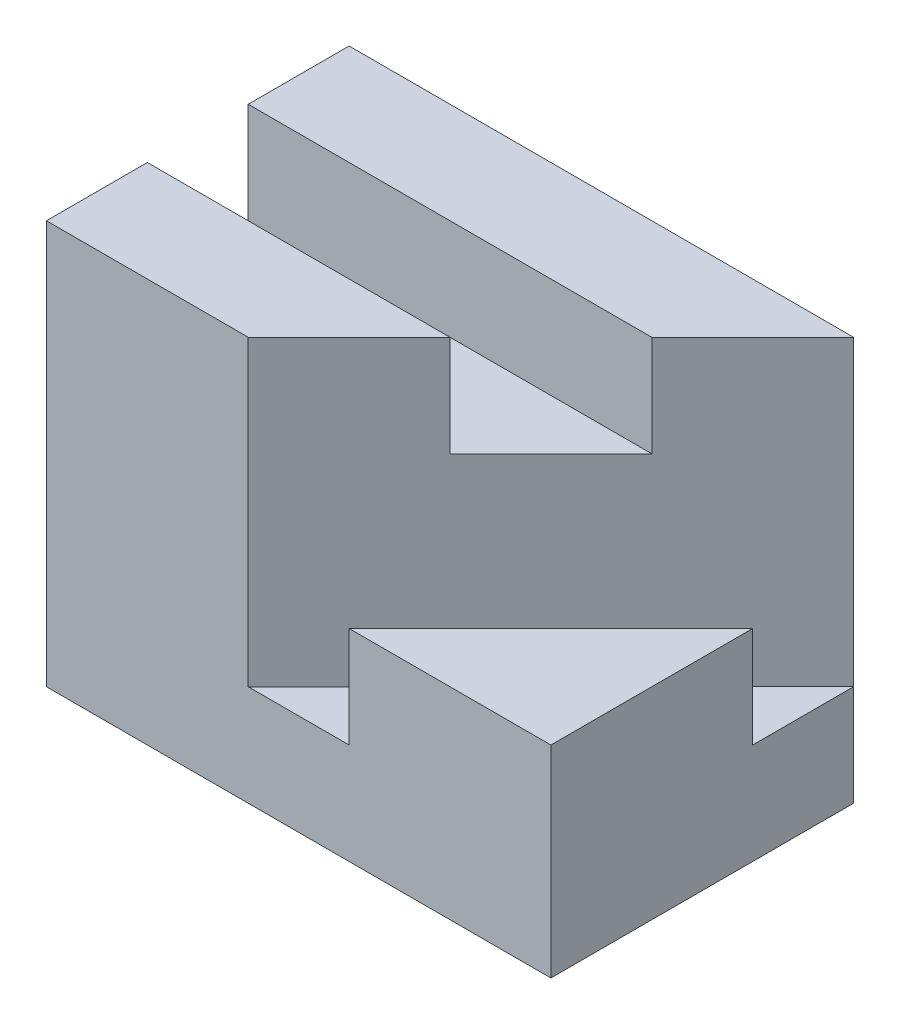
ISO-10303-21;
HEADER;
FILE_DESCRIPTION(('STEP AP214'),'2;1');
FILE_NAME('part.step','',(''),(''),'','','');
FILE_SCHEMA(('AUTOMOTIVE_DESIGN { 1 0 10303 214 1 1 1 1 }'));
ENDSEC;
DATA;
#1=APPLICATION_CONTEXT('core data for automotive mechanical design processes');
#2=APPLICATION_PROTOCOL_DEFINITION('international standard','automotive_design',2000,#1);
#3=PRODUCT_CONTEXT('',#1,'mechanical');
#4=PRODUCT('Part','Part','',(#3));
#5=PRODUCT_RELATED_PRODUCT_CATEGORY('part','',(#4));
#6=PRODUCT_DEFINITION_FORMATION('','',#4);
#7=PRODUCT_DEFINITION_CONTEXT('part definition',#1,'design');
#8=PRODUCT_DEFINITION('design','',#6,#7);
#9=PRODUCT_DEFINITION_SHAPE('','',#8);
#10=(LENGTH_UNIT() NAMED_UNIT(*) SI_UNIT(.MILLI.,.METRE.));
#11=(NAMED_UNIT(*) PLANE_ANGLE_UNIT() SI_UNIT($,.RADIAN.));
#12=(NAMED_UNIT(*) SI_UNIT($,.STERADIAN.) SOLID_ANGLE_UNIT());
#13=UNCERTAINTY_MEASURE_WITH_UNIT(LENGTH_MEASURE(1.E-05),#10,'distance_accuracy_value','');
#14=(GEOMETRIC_REPRESENTATION_CONTEXT(3) GLOBAL_UNCERTAINTY_ASSIGNED_CONTEXT((#13)) GLOBAL_UNIT_ASSIGNED_CONTEXT((#10,
#11,#12)) REPRESENTATION_CONTEXT('',''));
#15=CARTESIAN_POINT('',(0.,0.,0.));
#16=DIRECTION('',(0.,0.,1.));
#17=DIRECTION('',(1.,0.,0.));
#18=AXIS2_PLACEMENT_3D('',#15,#16,#17);
#19=CARTESIAN_POINT('',(2.5,4.,-1.5));
#20=DIRECTION('',(-1.,0.,0.));
#21=DIRECTION('',(0.,0.,1.));
#22=AXIS2_PLACEMENT_3D('',#19,#20,#21);
#23=PLANE('',#22);
#24=DIRECTION('',(0.,0.,-1.));
#25=VECTOR('',#24,1.);
#26=CARTESIAN_POINT('',(2.5,2.,0.));
#27=LINE('',#26,#25);
#28=CARTESIAN_POINT('',(2.5,2.,1.5));
#29=VERTEX_POINT('',#28);
#30=CARTESIAN_POINT('',(2.5,2.,-0.499999999999995));
#31=VERTEX_POINT('',#30);
#32=EDGE_CURVE('E48',#29,#31,#27,.T.);
#33=ORIENTED_EDGE('',*,*,#32,.F.);
#34=DIRECTION('',(0.,-1.,0.));
#35=VECTOR('',#34,1.);
#36=CARTESIAN_POINT('',(2.5,4.,1.5));
#37=LINE('',#36,#35);
#38=CARTESIAN_POINT('',(2.5,0.,1.5));
#39=VERTEX_POINT('',#38);
#40=EDGE_CURVE('E131',#29,#39,#37,.T.);
#41=ORIENTED_EDGE('',*,*,#40,.T.);
#42=DIRECTION('',(0.,0.,-1.));
#43=VECTOR('',#42,1.);
#44=CARTESIAN_POINT('',(2.5,0.,-1.5));
#45=LINE('',#44,#43);
#46=CARTESIAN_POINT('',(2.5,0.,-1.5));
#47=VERTEX_POINT('',#46);
#48=EDGE_CURVE('E187',#39,#47,#45,.T.);
#49=ORIENTED_EDGE('',*,*,#48,.T.);
#50=DIRECTION('',(0.,-1.,0.));
#51=VECTOR('',#50,1.);
#52=CARTESIAN_POINT('',(2.5,4.,-1.5));
#53=LINE('',#52,#51);
#54=CARTESIAN_POINT('',(2.5,1.,-1.5));
#55=VERTEX_POINT('',#54);
#56=EDGE_CURVE('E194',#55,#47,#53,.T.);
#57=ORIENTED_EDGE('',*,*,#56,.F.);
#58=DIRECTION('',(0.,0.,-1.));
#59=VECTOR('',#58,1.);
#60=CARTESIAN_POINT('',(2.5,1.,0.));
#61=LINE('',#60,#59);
#62=CARTESIAN_POINT('',(2.5,1.,-0.499999999999995));
#63=VERTEX_POINT('',#62);
#64=EDGE_CURVE('E138',#63,#55,#61,.T.);
#65=ORIENTED_EDGE('',*,*,#64,.F.);
#66=DIRECTION('',(0.,1.,0.));
#67=VECTOR('',#66,1.);
#68=CARTESIAN_POINT('',(2.5,1.,-0.499999999999995));
#69=LINE('',#68,#67);
#70=EDGE_CURVE('E137',#63,#31,#69,.T.);
#71=ORIENTED_EDGE('',*,*,#70,.T.);
#72=EDGE_LOOP('',(#33,#41,#49,#57,#65,#71));
#73=FACE_BOUND('',#72,.T.);
#74=ADVANCED_FACE('F33',(#73),#23,.F.);
#75=CARTESIAN_POINT('',(2.5,4.,1.5));
#76=DIRECTION('',(0.,0.,-1.));
#77=DIRECTION('',(-1.,0.,0.));
#78=AXIS2_PLACEMENT_3D('',#75,#76,#77);
#79=PLANE('',#78);
#80=DIRECTION('',(1.,0.,0.));
#81=VECTOR('',#80,1.);
#82=CARTESIAN_POINT('',(0.,2.,1.5));
#83=LINE('',#82,#81);
#84=CARTESIAN_POINT('',(0.5,2.,1.5));
#85=VERTEX_POINT('',#84);
#86=EDGE_CURVE('E119',#85,#29,#83,.T.);
#87=ORIENTED_EDGE('',*,*,#86,.F.);
#88=DIRECTION('',(0.,1.,0.));
#89=VECTOR('',#88,1.);
#90=CARTESIAN_POINT('',(0.5,1.,1.5));
#91=LINE('',#90,#89);
#92=CARTESIAN_POINT('',(0.5,1.,1.5));
#93=VERTEX_POINT('',#92);
#94=EDGE_CURVE('E129',#93,#85,#91,.T.);
#95=ORIENTED_EDGE('',*,*,#94,.F.);
#96=DIRECTION('',(1.,0.,0.));
#97=VECTOR('',#96,1.);
#98=CARTESIAN_POINT('',(0.,1.,1.5));
#99=LINE('',#98,#97);
#100=CARTESIAN_POINT('',(-0.500000000000013,1.,1.5));
#101=VERTEX_POINT('',#100);
#102=EDGE_CURVE('E215',#101,#93,#99,.T.);
#103=ORIENTED_EDGE('',*,*,#102,.F.);
#104=DIRECTION('',(0.,1.,0.));
#105=VECTOR('',#104,1.);
#106=CARTESIAN_POINT('',(-0.500000000000013,3.,1.5));
#107=LINE('',#106,#105);
#108=CARTESIAN_POINT('',(-0.500000000000013,4.,1.5));
#109=VERTEX_POINT('',#108);
#110=EDGE_CURVE('E169',#101,#109,#107,.T.);
#111=ORIENTED_EDGE('',*,*,#110,.T.);
#112=DIRECTION('',(1.,0.,0.));
#113=VECTOR('',#112,1.);
#114=CARTESIAN_POINT('',(2.5,4.,1.5));
#115=LINE('',#114,#113);
#116=CARTESIAN_POINT('',(-2.50000000000001,4.,1.5));
#117=VERTEX_POINT('',#116);
#118=EDGE_CURVE('E176',#117,#109,#115,.T.);
#119=ORIENTED_EDGE('',*,*,#118,.F.);
#120=DIRECTION('',(0.,-1.,0.));
#121=VECTOR('',#120,1.);
#122=CARTESIAN_POINT('',(-2.50000000000001,4.,1.5));
#123=LINE('',#122,#121);
#124=CARTESIAN_POINT('',(-2.50000000000001,0.,1.5));
#125=VERTEX_POINT('',#124);
#126=EDGE_CURVE('E41',#117,#125,#123,.T.);
#127=ORIENTED_EDGE('',*,*,#126,.T.);
#128=DIRECTION('',(1.,0.,0.));
#129=VECTOR('',#128,1.);
#130=CARTESIAN_POINT('',(2.5,0.,1.5));
#131=LINE('',#130,#129);
#132=EDGE_CURVE('E185',#125,#39,#131,.T.);
#133=ORIENTED_EDGE('',*,*,#132,.T.);
#134=ORIENTED_EDGE('',*,*,#40,.F.);
#135=EDGE_LOOP('',(#87,#95,#103,#111,#119,#127,#133,#134));
#136=FACE_BOUND('',#135,.T.);
#137=ADVANCED_FACE('F127',(#136),#79,.F.);
#138=CARTESIAN_POINT('',(1.,1.,1.));
#139=DIRECTION('',(0.707106781186547,0.,0.707106781186548));
#140=DIRECTION('',(0.707106781186548,0.,-0.707106781186547));
#141=AXIS2_PLACEMENT_3D('',#138,#139,#140);
#142=PLANE('',#141);
#143=DIRECTION('',(0.707106781186548,0.,-0.707106781186547));
#144=VECTOR('',#143,1.);
#145=CARTESIAN_POINT('',(1.,2.,1.));
#146=LINE('',#145,#144);
#147=EDGE_CURVE('E116',#85,#31,#146,.T.);
#148=ORIENTED_EDGE('',*,*,#147,.T.);
#149=ORIENTED_EDGE('',*,*,#70,.F.);
#150=DIRECTION('',(0.707106781186548,0.,-0.707106781186547));
#151=VECTOR('',#150,1.);
#152=CARTESIAN_POINT('',(1.,1.,1.));
#153=LINE('',#152,#151);
#154=EDGE_CURVE('E135',#93,#63,#153,.T.);
#155=ORIENTED_EDGE('',*,*,#154,.F.);
#156=ORIENTED_EDGE('',*,*,#94,.T.);
#157=EDGE_LOOP('',(#148,#149,#155,#156));
#158=FACE_BOUND('',#157,.T.);
#159=ADVANCED_FACE('F133',(#158),#142,.F.);
#160=CARTESIAN_POINT('',(0.,3.,0.));
#161=DIRECTION('',(0.,1.,0.));
#162=DIRECTION('',(0.,0.,1.));
#163=AXIS2_PLACEMENT_3D('',#160,#161,#162);
#164=PLANE('',#163);
#165=DIRECTION('',(-0.707106781186548,0.,0.707106781186547));
#166=VECTOR('',#165,1.);
#167=CARTESIAN_POINT('',(0.499999999999996,3.,0.499999999999997));
#168=LINE('',#167,#166);
#169=CARTESIAN_POINT('',(1.49999999999999,3.,-0.499999999999999));
#170=VERTEX_POINT('',#169);
#171=CARTESIAN_POINT('',(0.499999999999992,3.,0.500000000000001));
#172=VERTEX_POINT('',#171);
#173=EDGE_CURVE('E11',#170,#172,#168,.T.);
#174=ORIENTED_EDGE('',*,*,#173,.F.);
#175=DIRECTION('',(1.,0.,0.));
#176=VECTOR('',#175,1.);
#177=CARTESIAN_POINT('',(0.,3.,-0.499999999999998));
#178=LINE('',#177,#176);
#179=CARTESIAN_POINT('',(-2.50000000000001,3.,-0.499999999999998));
#180=VERTEX_POINT('',#179);
#181=EDGE_CURVE('E147',#180,#170,#178,.T.);
#182=ORIENTED_EDGE('',*,*,#181,.F.);
#183=DIRECTION('',(0.,0.,1.));
#184=VECTOR('',#183,1.);
#185=CARTESIAN_POINT('',(-2.50000000000001,3.,0.));
#186=LINE('',#185,#184);
#187=CARTESIAN_POINT('',(-2.50000000000001,3.,0.500000000000001));
#188=VERTEX_POINT('',#187);
#189=EDGE_CURVE('E151',#180,#188,#186,.T.);
#190=ORIENTED_EDGE('',*,*,#189,.T.);
#191=DIRECTION('',(1.,0.,0.));
#192=VECTOR('',#191,1.);
#193=CARTESIAN_POINT('',(0.,3.,0.500000000000001));
#194=LINE('',#193,#192);
#195=EDGE_CURVE('E144',#188,#172,#194,.T.);
#196=ORIENTED_EDGE('',*,*,#195,.T.);
#197=EDGE_LOOP('',(#174,#182,#190,#196));
#198=FACE_BOUND('',#197,.T.);
#199=ADVANCED_FACE('F231',(#198),#164,.T.);
#200=CARTESIAN_POINT('',(0.,4.,0.));
#201=DIRECTION('',(0.,-1.,0.));
#202=DIRECTION('',(0.,0.,-1.));
#203=AXIS2_PLACEMENT_3D('',#200,#201,#202);
#204=PLANE('',#203);
#205=DIRECTION('',(1.,0.,0.));
#206=VECTOR('',#205,1.);
#207=CARTESIAN_POINT('',(0.,4.,-0.499999999999998));
#208=LINE('',#207,#206);
#209=CARTESIAN_POINT('',(-2.50000000000001,4.,-0.499999999999998));
#210=VERTEX_POINT('',#209);
#211=CARTESIAN_POINT('',(1.49999999999999,4.,-0.499999999999999));
#212=VERTEX_POINT('',#211);
#213=EDGE_CURVE('E148',#210,#212,#208,.T.);
#214=ORIENTED_EDGE('',*,*,#213,.T.);
#215=DIRECTION('',(-0.707106781186548,0.,0.707106781186547));
#216=VECTOR('',#215,1.);
#217=CARTESIAN_POINT('',(0.499999999999996,4.,0.499999999999997));
#218=LINE('',#217,#216);
#219=CARTESIAN_POINT('',(2.5,4.,-1.5));
#220=VERTEX_POINT('',#219);
#221=EDGE_CURVE('E158',#220,#212,#218,.T.);
#222=ORIENTED_EDGE('',*,*,#221,.F.);
#223=DIRECTION('',(-1.,0.,0.));
#224=VECTOR('',#223,1.);
#225=CARTESIAN_POINT('',(2.5,4.,-1.5));
#226=LINE('',#225,#224);
#227=CARTESIAN_POINT('',(-2.50000000000001,4.,-1.5));
#228=VERTEX_POINT('',#227);
#229=EDGE_CURVE('E180',#220,#228,#226,.T.);
#230=ORIENTED_EDGE('',*,*,#229,.T.);
#231=DIRECTION('',(0.,0.,1.));
#232=VECTOR('',#231,1.);
#233=CARTESIAN_POINT('',(-2.50000000000001,4.,-1.5));
#234=LINE('',#233,#232);
#235=EDGE_CURVE('E173',#228,#210,#234,.T.);
#236=ORIENTED_EDGE('',*,*,#235,.T.);
#237=EDGE_LOOP('',(#214,#222,#230,#236));
#238=FACE_BOUND('',#237,.T.);
#239=ADVANCED_FACE('F240',(#238),#204,.F.);
#240=CARTESIAN_POINT('',(-2.50000000000001,4.,-1.5));
#241=DIRECTION('',(1.,0.,0.));
#242=DIRECTION('',(0.,0.,-1.));
#243=AXIS2_PLACEMENT_3D('',#240,#241,#242);
#244=PLANE('',#243);
#245=CARTESIAN_POINT('',(-2.50000000000001,4.,0.500000000000001));
#246=VERTEX_POINT('',#245);
#247=EDGE_CURVE('E177',#246,#117,#234,.T.);
#248=ORIENTED_EDGE('',*,*,#247,.F.);
#249=DIRECTION('',(0.,1.,0.));
#250=VECTOR('',#249,1.);
#251=CARTESIAN_POINT('',(-2.50000000000001,3.,0.500000000000001));
#252=LINE('',#251,#250);
#253=EDGE_CURVE('E161',#188,#246,#252,.T.);
#254=ORIENTED_EDGE('',*,*,#253,.F.);
#255=ORIENTED_EDGE('',*,*,#189,.F.);
#256=DIRECTION('',(0.,1.,0.));
#257=VECTOR('',#256,1.);
#258=CARTESIAN_POINT('',(-2.50000000000001,3.,-0.499999999999998));
#259=LINE('',#258,#257);
#260=EDGE_CURVE('E164',#180,#210,#259,.T.);
#261=ORIENTED_EDGE('',*,*,#260,.T.);
#262=ORIENTED_EDGE('',*,*,#235,.F.);
#263=DIRECTION('',(0.,-1.,0.));
#264=VECTOR('',#263,1.);
#265=CARTESIAN_POINT('',(-2.50000000000001,4.,-1.5));
#266=LINE('',#265,#264);
#267=CARTESIAN_POINT('',(-2.50000000000001,0.,-1.5));
#268=VERTEX_POINT('',#267);
#269=EDGE_CURVE('E182',#228,#268,#266,.T.);
#270=ORIENTED_EDGE('',*,*,#269,.T.);
#271=DIRECTION('',(0.,0.,1.));
#272=VECTOR('',#271,1.);
#273=CARTESIAN_POINT('',(-2.50000000000001,0.,-1.5));
#274=LINE('',#273,#272);
#275=EDGE_CURVE('E163',#268,#125,#274,.T.);
#276=ORIENTED_EDGE('',*,*,#275,.T.);
#277=ORIENTED_EDGE('',*,*,#126,.F.);
#278=EDGE_LOOP('',(#248,#254,#255,#261,#262,#270,#276,#277));
#279=FACE_BOUND('',#278,.T.);
#280=ADVANCED_FACE('F35',(#279),#244,.F.);
#281=CARTESIAN_POINT('',(2.5,4.,-1.5));
#282=DIRECTION('',(0.,0.,1.));
#283=DIRECTION('',(1.,0.,0.));
#284=AXIS2_PLACEMENT_3D('',#281,#282,#283);
#285=PLANE('',#284);
#286=DIRECTION('',(-1.,0.,0.));
#287=VECTOR('',#286,1.);
#288=CARTESIAN_POINT('',(2.5,0.,-1.5));
#289=LINE('',#288,#287);
#290=EDGE_CURVE('E190',#47,#268,#289,.T.);
#291=ORIENTED_EDGE('',*,*,#290,.T.);
#292=ORIENTED_EDGE('',*,*,#269,.F.);
#293=ORIENTED_EDGE('',*,*,#229,.F.);
#294=EDGE_CURVE('E195',#220,#55,#53,.T.);
#295=ORIENTED_EDGE('',*,*,#294,.T.);
#296=ORIENTED_EDGE('',*,*,#56,.T.);
#297=EDGE_LOOP('',(#291,#292,#293,#295,#296));
#298=FACE_BOUND('',#297,.T.);
#299=ADVANCED_FACE('F242',(#298),#285,.F.);
#300=CARTESIAN_POINT('',(0.499999999999993,4.,0.500000000000001));
#301=VERTEX_POINT('',#300);
#302=EDGE_CURVE('E156',#301,#109,#218,.T.);
#303=ORIENTED_EDGE('',*,*,#302,.F.);
#304=DIRECTION('',(1.,0.,0.));
#305=VECTOR('',#304,1.);
#306=CARTESIAN_POINT('',(0.,4.,0.500000000000001));
#307=LINE('',#306,#305);
#308=EDGE_CURVE('E56',#246,#301,#307,.T.);
#309=ORIENTED_EDGE('',*,*,#308,.F.);
#310=ORIENTED_EDGE('',*,*,#247,.T.);
#311=ORIENTED_EDGE('',*,*,#118,.T.);
#312=EDGE_LOOP('',(#303,#309,#310,#311));
#313=FACE_BOUND('',#312,.T.);
#314=ADVANCED_FACE('F225',(#313),#204,.F.);
#315=CARTESIAN_POINT('',(0.,0.,0.));
#316=DIRECTION('',(0.,-1.,0.));
#317=DIRECTION('',(0.,0.,-1.));
#318=AXIS2_PLACEMENT_3D('',#315,#316,#317);
#319=PLANE('',#318);
#320=ORIENTED_EDGE('',*,*,#275,.F.);
#321=ORIENTED_EDGE('',*,*,#290,.F.);
#322=ORIENTED_EDGE('',*,*,#48,.F.);
#323=ORIENTED_EDGE('',*,*,#132,.F.);
#324=EDGE_LOOP('',(#320,#321,#322,#323));
#325=FACE_BOUND('',#324,.T.);
#326=ADVANCED_FACE('F208',(#325),#319,.T.);
#327=CARTESIAN_POINT('',(0.,3.,0.500000000000001));
#328=DIRECTION('',(0.,0.,1.));
#329=DIRECTION('',(1.,0.,0.));
#330=AXIS2_PLACEMENT_3D('',#327,#328,#329);
#331=PLANE('',#330);
#332=ORIENTED_EDGE('',*,*,#308,.T.);
#333=DIRECTION('',(0.,1.,0.));
#334=VECTOR('',#333,1.);
#335=CARTESIAN_POINT('',(0.499999999999993,3.,0.500000000000001));
#336=LINE('',#335,#334);
#337=EDGE_CURVE('E154',#172,#301,#336,.T.);
#338=ORIENTED_EDGE('',*,*,#337,.F.);
#339=ORIENTED_EDGE('',*,*,#195,.F.);
#340=ORIENTED_EDGE('',*,*,#253,.T.);
#341=EDGE_LOOP('',(#332,#338,#339,#340));
#342=FACE_BOUND('',#341,.T.);
#343=ADVANCED_FACE('F228',(#342),#331,.F.);
#344=CARTESIAN_POINT('',(0.,3.,-0.499999999999998));
#345=DIRECTION('',(0.,0.,1.));
#346=DIRECTION('',(1.,0.,0.));
#347=AXIS2_PLACEMENT_3D('',#344,#345,#346);
#348=PLANE('',#347);
#349=ORIENTED_EDGE('',*,*,#213,.F.);
#350=ORIENTED_EDGE('',*,*,#260,.F.);
#351=ORIENTED_EDGE('',*,*,#181,.T.);
#352=DIRECTION('',(0.,1.,0.));
#353=VECTOR('',#352,1.);
#354=CARTESIAN_POINT('',(1.49999999999999,3.,-0.499999999999999));
#355=LINE('',#354,#353);
#356=EDGE_CURVE('E167',#170,#212,#355,.T.);
#357=ORIENTED_EDGE('',*,*,#356,.T.);
#358=EDGE_LOOP('',(#349,#350,#351,#357));
#359=FACE_BOUND('',#358,.T.);
#360=ADVANCED_FACE('F234',(#359),#348,.T.);
#361=CARTESIAN_POINT('',(0.499999999999996,3.,0.499999999999997));
#362=DIRECTION('',(-0.707106781186547,0.,-0.707106781186548));
#363=DIRECTION('',(-0.707106781186548,0.,0.707106781186547));
#364=AXIS2_PLACEMENT_3D('',#361,#362,#363);
#365=PLANE('',#364);
#366=ORIENTED_EDGE('',*,*,#221,.T.);
#367=ORIENTED_EDGE('',*,*,#356,.F.);
#368=ORIENTED_EDGE('',*,*,#173,.T.);
#369=ORIENTED_EDGE('',*,*,#337,.T.);
#370=ORIENTED_EDGE('',*,*,#302,.T.);
#371=ORIENTED_EDGE('',*,*,#110,.F.);
#372=DIRECTION('',(-0.707106781186548,0.,0.707106781186547));
#373=VECTOR('',#372,1.);
#374=CARTESIAN_POINT('',(0.499999999999996,1.,0.499999999999997));
#375=LINE('',#374,#373);
#376=EDGE_CURVE('E212',#55,#101,#375,.T.);
#377=ORIENTED_EDGE('',*,*,#376,.F.);
#378=ORIENTED_EDGE('',*,*,#294,.F.);
#379=EDGE_LOOP('',(#366,#367,#368,#369,#370,#371,#377,#378));
#380=FACE_BOUND('',#379,.T.);
#381=ADVANCED_FACE('F236',(#380),#365,.F.);
#382=CARTESIAN_POINT('',(0.,1.,0.));
#383=DIRECTION('',(0.,1.,0.));
#384=DIRECTION('',(0.,0.,1.));
#385=AXIS2_PLACEMENT_3D('',#382,#383,#384);
#386=PLANE('',#385);
#387=ORIENTED_EDGE('',*,*,#376,.T.);
#388=ORIENTED_EDGE('',*,*,#102,.T.);
#389=ORIENTED_EDGE('',*,*,#154,.T.);
#390=ORIENTED_EDGE('',*,*,#64,.T.);
#391=EDGE_LOOP('',(#387,#388,#389,#390));
#392=FACE_BOUND('',#391,.T.);
#393=ADVANCED_FACE('F220',(#392),#386,.T.);
#394=CARTESIAN_POINT('',(0.,2.,0.));
#395=DIRECTION('',(0.,1.,0.));
#396=DIRECTION('',(0.,0.,1.));
#397=AXIS2_PLACEMENT_3D('',#394,#395,#396);
#398=PLANE('',#397);
#399=ORIENTED_EDGE('',*,*,#147,.F.);
#400=ORIENTED_EDGE('',*,*,#86,.T.);
#401=ORIENTED_EDGE('',*,*,#32,.T.);
#402=EDGE_LOOP('',(#399,#400,#401));
#403=FACE_BOUND('',#402,.T.);
#404=ADVANCED_FACE('F118',(#403),#398,.T.);
#405=CLOSED_SHELL('',(#74,#137,#159,#199,#239,#280,#299,#314,#326,#343,#360,#381,#393,#404));
#406=MANIFOLD_SOLID_BREP('B2',#405);
#407=ADVANCED_BREP_SHAPE_REPRESENTATION('',(#18,#406),#14);
#408=SHAPE_DEFINITION_REPRESENTATION(#9,#407);
ENDSEC;
END-ISO-10303-21;
